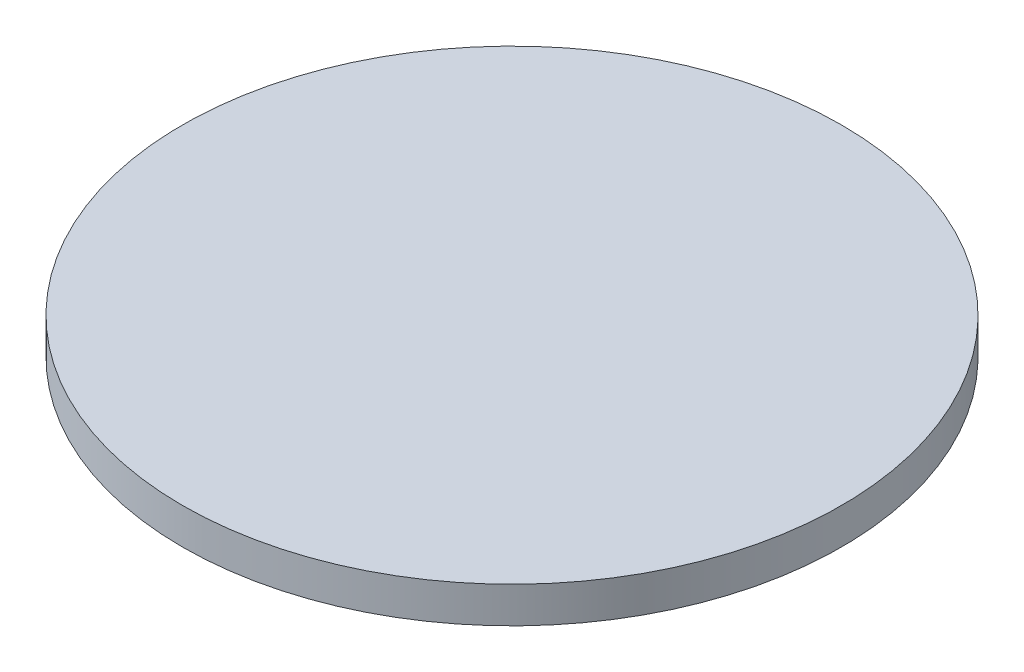
ISO-10303-21;
HEADER;
FILE_DESCRIPTION(('STEP AP214'),'2;1');
FILE_NAME('part.step','',(''),(''),'','','');
FILE_SCHEMA(('AUTOMOTIVE_DESIGN { 1 0 10303 214 1 1 1 1 }'));
ENDSEC;
DATA;
#1=APPLICATION_CONTEXT('core data for automotive mechanical design processes');
#2=APPLICATION_PROTOCOL_DEFINITION('international standard','automotive_design',2000,#1);
#3=PRODUCT_CONTEXT('',#1,'mechanical');
#4=PRODUCT('Part','Part','',(#3));
#5=PRODUCT_RELATED_PRODUCT_CATEGORY('part','',(#4));
#6=PRODUCT_DEFINITION_FORMATION('','',#4);
#7=PRODUCT_DEFINITION_CONTEXT('part definition',#1,'design');
#8=PRODUCT_DEFINITION('design','',#6,#7);
#9=PRODUCT_DEFINITION_SHAPE('','',#8);
#10=(LENGTH_UNIT() NAMED_UNIT(*) SI_UNIT(.MILLI.,.METRE.));
#11=(NAMED_UNIT(*) PLANE_ANGLE_UNIT() SI_UNIT($,.RADIAN.));
#12=(NAMED_UNIT(*) SI_UNIT($,.STERADIAN.) SOLID_ANGLE_UNIT());
#13=UNCERTAINTY_MEASURE_WITH_UNIT(LENGTH_MEASURE(1.E-05),#10,'distance_accuracy_value','');
#14=(GEOMETRIC_REPRESENTATION_CONTEXT(3) GLOBAL_UNCERTAINTY_ASSIGNED_CONTEXT((#13)) GLOBAL_UNIT_ASSIGNED_CONTEXT((#10,
#11,#12)) REPRESENTATION_CONTEXT('',''));
#15=CARTESIAN_POINT('',(0.,0.,0.));
#16=DIRECTION('',(0.,0.,1.));
#17=DIRECTION('',(1.,0.,0.));
#18=AXIS2_PLACEMENT_3D('',#15,#16,#17);
#19=CARTESIAN_POINT('',(0.,7.,0.));
#20=DIRECTION('',(0.,-1.,0.));
#21=DIRECTION('',(0.,0.,-1.));
#22=AXIS2_PLACEMENT_3D('',#19,#20,#21);
#23=CYLINDRICAL_SURFACE('',#22,64.);
#24=CARTESIAN_POINT('',(0.,7.,0.));
#25=DIRECTION('',(0.,1.,0.));
#26=DIRECTION('',(0.,0.,1.));
#27=AXIS2_PLACEMENT_3D('',#24,#25,#26);
#28=CIRCLE('',#27,64.);
#29=CARTESIAN_POINT('',(0.,7.,64.));
#30=VERTEX_POINT('',#29);
#31=EDGE_CURVE('E10',#30,#30,#28,.T.);
#32=ORIENTED_EDGE('',*,*,#31,.F.);
#33=EDGE_LOOP('',(#32));
#34=FACE_BOUND('',#33,.T.);
#35=CARTESIAN_POINT('',(0.,0.,0.));
#36=DIRECTION('',(0.,1.,0.));
#37=DIRECTION('',(0.,0.,1.));
#38=AXIS2_PLACEMENT_3D('',#35,#36,#37);
#39=CIRCLE('',#38,64.);
#40=CARTESIAN_POINT('',(0.,0.,64.));
#41=VERTEX_POINT('',#40);
#42=EDGE_CURVE('E40',#41,#41,#39,.T.);
#43=ORIENTED_EDGE('',*,*,#42,.T.);
#44=EDGE_LOOP('',(#43));
#45=FACE_BOUND('',#44,.T.);
#46=ADVANCED_FACE('F37',(#34,#45),#23,.T.);
#47=CARTESIAN_POINT('',(0.,7.,0.));
#48=DIRECTION('',(0.,1.,0.));
#49=DIRECTION('',(0.,0.,1.));
#50=AXIS2_PLACEMENT_3D('',#47,#48,#49);
#51=PLANE('',#50);
#52=ORIENTED_EDGE('',*,*,#31,.T.);
#53=EDGE_LOOP('',(#52));
#54=FACE_BOUND('',#53,.T.);
#55=ADVANCED_FACE('F54',(#54),#51,.T.);
#56=CARTESIAN_POINT('',(0.,0.,0.));
#57=DIRECTION('',(0.,1.,0.));
#58=DIRECTION('',(0.,0.,1.));
#59=AXIS2_PLACEMENT_3D('',#56,#57,#58);
#60=PLANE('',#59);
#61=ORIENTED_EDGE('',*,*,#42,.F.);
#62=EDGE_LOOP('',(#61));
#63=FACE_BOUND('',#62,.T.);
#64=ADVANCED_FACE('F52',(#63),#60,.F.);
#65=CLOSED_SHELL('',(#46,#55,#64));
#66=MANIFOLD_SOLID_BREP('B2',#65);
#67=ADVANCED_BREP_SHAPE_REPRESENTATION('',(#18,#66),#14);
#68=SHAPE_DEFINITION_REPRESENTATION(#9,#67);
ENDSEC;
END-ISO-10303-21;
